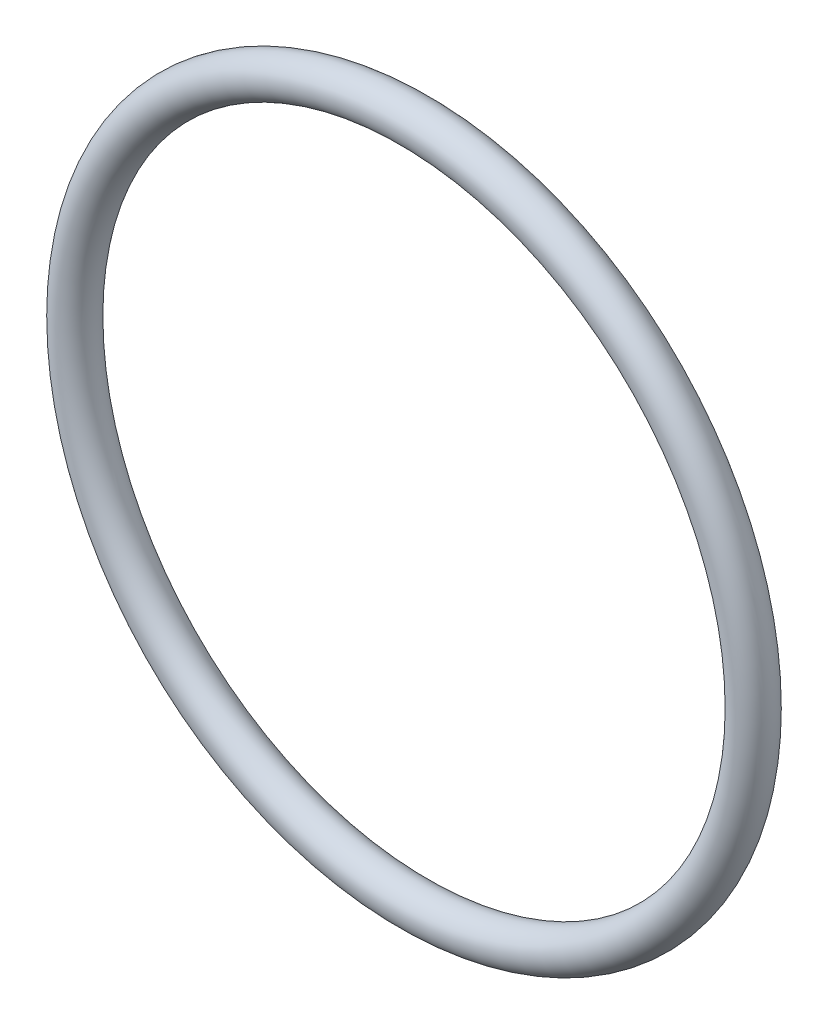
ISO-10303-21;
HEADER;
FILE_DESCRIPTION(('STEP AP214'),'2;1');
FILE_NAME('part.step','',(''),(''),'','','');
FILE_SCHEMA(('AUTOMOTIVE_DESIGN { 1 0 10303 214 1 1 1 1 }'));
ENDSEC;
DATA;
#1=APPLICATION_CONTEXT('core data for automotive mechanical design processes');
#2=APPLICATION_PROTOCOL_DEFINITION('international standard','automotive_design',2000,#1);
#3=PRODUCT_CONTEXT('',#1,'mechanical');
#4=PRODUCT('Part','Part','',(#3));
#5=PRODUCT_RELATED_PRODUCT_CATEGORY('part','',(#4));
#6=PRODUCT_DEFINITION_FORMATION('','',#4);
#7=PRODUCT_DEFINITION_CONTEXT('part definition',#1,'design');
#8=PRODUCT_DEFINITION('design','',#6,#7);
#9=PRODUCT_DEFINITION_SHAPE('','',#8);
#10=(LENGTH_UNIT() NAMED_UNIT(*) SI_UNIT(.MILLI.,.METRE.));
#11=(NAMED_UNIT(*) PLANE_ANGLE_UNIT() SI_UNIT($,.RADIAN.));
#12=(NAMED_UNIT(*) SI_UNIT($,.STERADIAN.) SOLID_ANGLE_UNIT());
#13=UNCERTAINTY_MEASURE_WITH_UNIT(LENGTH_MEASURE(1.E-05),#10,'distance_accuracy_value','');
#14=(GEOMETRIC_REPRESENTATION_CONTEXT(3) GLOBAL_UNCERTAINTY_ASSIGNED_CONTEXT((#13)) GLOBAL_UNIT_ASSIGNED_CONTEXT((#10,
#11,#12)) REPRESENTATION_CONTEXT('',''));
#15=CARTESIAN_POINT('',(0.,0.,0.));
#16=DIRECTION('',(0.,0.,1.));
#17=DIRECTION('',(1.,0.,0.));
#18=AXIS2_PLACEMENT_3D('',#15,#16,#17);
#19=CARTESIAN_POINT('',(0.,0.,0.));
#20=DIRECTION('',(0.,0.,1.));
#21=DIRECTION('',(1.,0.,0.));
#22=AXIS2_PLACEMENT_3D('',#19,#20,#21);
#23=TOROIDAL_SURFACE('',#22,30.1371,1.76530000000001);
#24=CARTESIAN_POINT('',(31.9024,0.,0.));
#25=VERTEX_POINT('',#24);
#26=VERTEX_LOOP('',#25);
#27=FACE_BOUND('',#26,.T.);
#28=ADVANCED_FACE('F30',(#27),#23,.T.);
#29=CLOSED_SHELL('',(#28));
#30=MANIFOLD_SOLID_BREP('B2',#29);
#31=ADVANCED_BREP_SHAPE_REPRESENTATION('',(#18,#30),#14);
#32=SHAPE_DEFINITION_REPRESENTATION(#9,#31);
ENDSEC;
END-ISO-10303-21;
